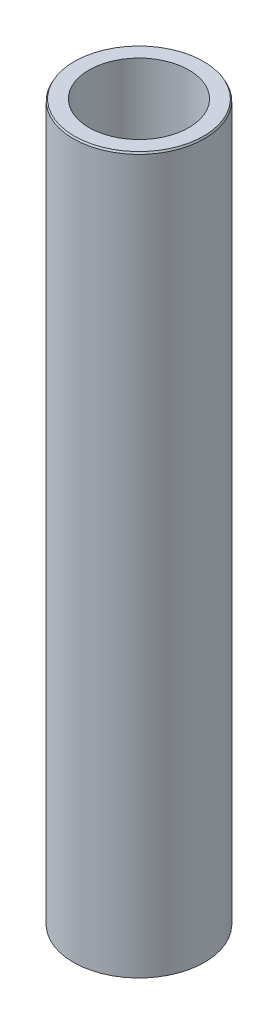
ISO-10303-21;
HEADER;
FILE_DESCRIPTION(('STEP AP214'),'2;1');
FILE_NAME('part.step','',(''),(''),'','','');
FILE_SCHEMA(('AUTOMOTIVE_DESIGN { 1 0 10303 214 1 1 1 1 }'));
ENDSEC;
DATA;
#1=APPLICATION_CONTEXT('core data for automotive mechanical design processes');
#2=APPLICATION_PROTOCOL_DEFINITION('international standard','automotive_design',2000,#1);
#3=PRODUCT_CONTEXT('',#1,'mechanical');
#4=PRODUCT('Part','Part','',(#3));
#5=PRODUCT_RELATED_PRODUCT_CATEGORY('part','',(#4));
#6=PRODUCT_DEFINITION_FORMATION('','',#4);
#7=PRODUCT_DEFINITION_CONTEXT('part definition',#1,'design');
#8=PRODUCT_DEFINITION('design','',#6,#7);
#9=PRODUCT_DEFINITION_SHAPE('','',#8);
#10=(LENGTH_UNIT() NAMED_UNIT(*) SI_UNIT(.MILLI.,.METRE.));
#11=(NAMED_UNIT(*) PLANE_ANGLE_UNIT() SI_UNIT($,.RADIAN.));
#12=(NAMED_UNIT(*) SI_UNIT($,.STERADIAN.) SOLID_ANGLE_UNIT());
#13=UNCERTAINTY_MEASURE_WITH_UNIT(LENGTH_MEASURE(1.E-05),#10,'distance_accuracy_value','');
#14=(GEOMETRIC_REPRESENTATION_CONTEXT(3) GLOBAL_UNCERTAINTY_ASSIGNED_CONTEXT((#13)) GLOBAL_UNIT_ASSIGNED_CONTEXT((#10,
#11,#12)) REPRESENTATION_CONTEXT('',''));
#15=CARTESIAN_POINT('',(0.,0.,0.));
#16=DIRECTION('',(0.,0.,1.));
#17=DIRECTION('',(1.,0.,0.));
#18=AXIS2_PLACEMENT_3D('',#15,#16,#17);
#19=CARTESIAN_POINT('',(0.,600.,0.));
#20=DIRECTION('',(0.,-1.,0.));
#21=DIRECTION('',(0.,0.,-1.));
#22=AXIS2_PLACEMENT_3D('',#19,#20,#21);
#23=CYLINDRICAL_SURFACE('',#22,55.);
#24=CARTESIAN_POINT('',(0.,598.528178362275,0.));
#25=DIRECTION('',(0.,1.,0.));
#26=DIRECTION('',(0.,0.,1.));
#27=AXIS2_PLACEMENT_3D('',#24,#25,#26);
#28=CIRCLE('',#27,55.);
#29=CARTESIAN_POINT('',(0.,598.528178362275,55.));
#30=VERTEX_POINT('',#29);
#31=EDGE_CURVE('E50',#30,#30,#28,.F.);
#32=ORIENTED_EDGE('',*,*,#31,.T.);
#33=EDGE_LOOP('',(#32));
#34=FACE_BOUND('',#33,.T.);
#35=CARTESIAN_POINT('',(0.,0.810370982587405,0.));
#36=DIRECTION('',(0.,1.,0.));
#37=DIRECTION('',(0.,0.,1.));
#38=AXIS2_PLACEMENT_3D('',#35,#36,#37);
#39=CIRCLE('',#38,55.);
#40=CARTESIAN_POINT('',(0.,0.810370982587405,55.));
#41=VERTEX_POINT('',#40);
#42=EDGE_CURVE('E51',#41,#41,#39,.T.);
#43=ORIENTED_EDGE('',*,*,#42,.T.);
#44=EDGE_LOOP('',(#43));
#45=FACE_BOUND('',#44,.T.);
#46=ADVANCED_FACE('F39',(#34,#45),#23,.T.);
#47=CARTESIAN_POINT('',(0.,600.,0.));
#48=DIRECTION('',(0.,1.,0.));
#49=DIRECTION('',(0.,0.,1.));
#50=AXIS2_PLACEMENT_3D('',#47,#48,#49);
#51=PLANE('',#50);
#52=CARTESIAN_POINT('',(0.,600.,0.));
#53=DIRECTION('',(0.,1.,0.));
#54=DIRECTION('',(0.,0.,1.));
#55=AXIS2_PLACEMENT_3D('',#52,#53,#54);
#56=CIRCLE('',#55,54.1896290174125);
#57=CARTESIAN_POINT('',(0.,600.,54.1896290174125));
#58=VERTEX_POINT('',#57);
#59=EDGE_CURVE('E54',#58,#58,#56,.T.);
#60=ORIENTED_EDGE('',*,*,#59,.T.);
#61=EDGE_LOOP('',(#60));
#62=FACE_BOUND('',#61,.T.);
#63=CARTESIAN_POINT('',(0.,600.,0.));
#64=DIRECTION('',(0.,1.,0.));
#65=DIRECTION('',(0.,0.,1.));
#66=AXIS2_PLACEMENT_3D('',#63,#64,#65);
#67=CIRCLE('',#66,41.8463245625122);
#68=CARTESIAN_POINT('',(0.,600.,41.8463245625122));
#69=VERTEX_POINT('',#68);
#70=EDGE_CURVE('E58',#69,#69,#67,.T.);
#71=ORIENTED_EDGE('',*,*,#70,.F.);
#72=EDGE_LOOP('',(#71));
#73=FACE_BOUND('',#72,.T.);
#74=ADVANCED_FACE('F69',(#62,#73),#51,.T.);
#75=CARTESIAN_POINT('',(0.,0.,0.));
#76=DIRECTION('',(0.,1.,0.));
#77=DIRECTION('',(0.,0.,1.));
#78=AXIS2_PLACEMENT_3D('',#75,#76,#77);
#79=PLANE('',#78);
#80=CARTESIAN_POINT('',(0.,0.,0.));
#81=DIRECTION('',(0.,1.,0.));
#82=DIRECTION('',(0.,0.,1.));
#83=AXIS2_PLACEMENT_3D('',#80,#81,#82);
#84=CIRCLE('',#83,53.5281783622745);
#85=CARTESIAN_POINT('',(0.,0.,53.5281783622745));
#86=VERTEX_POINT('',#85);
#87=EDGE_CURVE('E10',#86,#86,#84,.F.);
#88=ORIENTED_EDGE('',*,*,#87,.T.);
#89=EDGE_LOOP('',(#88));
#90=FACE_BOUND('',#89,.T.);
#91=CARTESIAN_POINT('',(0.,0.,0.));
#92=DIRECTION('',(0.,1.,0.));
#93=DIRECTION('',(0.,0.,1.));
#94=AXIS2_PLACEMENT_3D('',#91,#92,#93);
#95=CIRCLE('',#94,41.8463245625122);
#96=CARTESIAN_POINT('',(0.,0.,41.8463245625122));
#97=VERTEX_POINT('',#96);
#98=EDGE_CURVE('E63',#97,#97,#95,.T.);
#99=ORIENTED_EDGE('',*,*,#98,.T.);
#100=EDGE_LOOP('',(#99));
#101=FACE_BOUND('',#100,.T.);
#102=ADVANCED_FACE('F75',(#90,#101),#79,.F.);
#103=CARTESIAN_POINT('',(0.,600.,0.));
#104=DIRECTION('',(0.,-1.,0.));
#105=DIRECTION('',(0.,0.,-1.));
#106=AXIS2_PLACEMENT_3D('',#103,#104,#105);
#107=CYLINDRICAL_SURFACE('',#106,41.8463245625122);
#108=ORIENTED_EDGE('',*,*,#70,.T.);
#109=EDGE_LOOP('',(#108));
#110=FACE_BOUND('',#109,.T.);
#111=ORIENTED_EDGE('',*,*,#98,.F.);
#112=EDGE_LOOP('',(#111));
#113=FACE_BOUND('',#112,.T.);
#114=ADVANCED_FACE('F70',(#110,#113),#107,.F.);
#115=CARTESIAN_POINT('',(0.,600.,0.));
#116=DIRECTION('',(0.,-1.,0.));
#117=DIRECTION('',(0.,0.,-1.));
#118=AXIS2_PLACEMENT_3D('',#115,#116,#117);
#119=CONICAL_SURFACE('',#118,54.1896290174125,0.503296441770516);
#120=ORIENTED_EDGE('',*,*,#31,.F.);
#121=EDGE_LOOP('',(#120));
#122=FACE_BOUND('',#121,.T.);
#123=ORIENTED_EDGE('',*,*,#59,.F.);
#124=EDGE_LOOP('',(#123));
#125=FACE_BOUND('',#124,.T.);
#126=ADVANCED_FACE('F81',(#122,#125),#119,.T.);
#127=CARTESIAN_POINT('',(0.,0.810370982587405,0.));
#128=DIRECTION('',(0.,1.,0.));
#129=DIRECTION('',(0.,0.,1.));
#130=AXIS2_PLACEMENT_3D('',#127,#128,#129);
#131=CONICAL_SURFACE('',#130,55.,1.0674998850244);
#132=ORIENTED_EDGE('',*,*,#87,.F.);
#133=EDGE_LOOP('',(#132));
#134=FACE_BOUND('',#133,.T.);
#135=ORIENTED_EDGE('',*,*,#42,.F.);
#136=EDGE_LOOP('',(#135));
#137=FACE_BOUND('',#136,.T.);
#138=ADVANCED_FACE('F45',(#134,#137),#131,.T.);
#139=CLOSED_SHELL('',(#46,#74,#102,#114,#126,#138));
#140=MANIFOLD_SOLID_BREP('B2',#139);
#141=ADVANCED_BREP_SHAPE_REPRESENTATION('',(#18,#140),#14);
#142=SHAPE_DEFINITION_REPRESENTATION(#9,#141);
ENDSEC;
END-ISO-10303-21;
